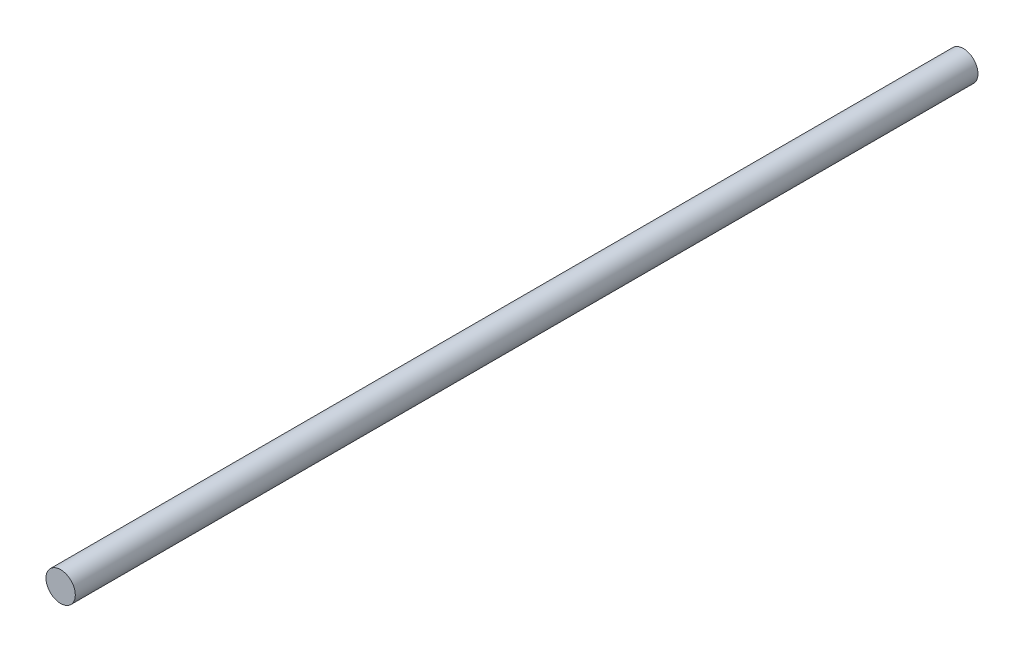
ISO-10303-21;
HEADER;
FILE_DESCRIPTION(('STEP AP214'),'2;1');
FILE_NAME('part.step','',(''),(''),'','','');
FILE_SCHEMA(('AUTOMOTIVE_DESIGN { 1 0 10303 214 1 1 1 1 }'));
ENDSEC;
DATA;
#1=APPLICATION_CONTEXT('core data for automotive mechanical design processes');
#2=APPLICATION_PROTOCOL_DEFINITION('international standard','automotive_design',2000,#1);
#3=PRODUCT_CONTEXT('',#1,'mechanical');
#4=PRODUCT('Part','Part','',(#3));
#5=PRODUCT_RELATED_PRODUCT_CATEGORY('part','',(#4));
#6=PRODUCT_DEFINITION_FORMATION('','',#4);
#7=PRODUCT_DEFINITION_CONTEXT('part definition',#1,'design');
#8=PRODUCT_DEFINITION('design','',#6,#7);
#9=PRODUCT_DEFINITION_SHAPE('','',#8);
#10=(LENGTH_UNIT() NAMED_UNIT(*) SI_UNIT(.MILLI.,.METRE.));
#11=(NAMED_UNIT(*) PLANE_ANGLE_UNIT() SI_UNIT($,.RADIAN.));
#12=(NAMED_UNIT(*) SI_UNIT($,.STERADIAN.) SOLID_ANGLE_UNIT());
#13=UNCERTAINTY_MEASURE_WITH_UNIT(LENGTH_MEASURE(1.E-05),#10,'distance_accuracy_value','');
#14=(GEOMETRIC_REPRESENTATION_CONTEXT(3) GLOBAL_UNCERTAINTY_ASSIGNED_CONTEXT((#13)) GLOBAL_UNIT_ASSIGNED_CONTEXT((#10,
#11,#12)) REPRESENTATION_CONTEXT('',''));
#15=CARTESIAN_POINT('',(0.,0.,0.));
#16=DIRECTION('',(0.,0.,1.));
#17=DIRECTION('',(1.,0.,0.));
#18=AXIS2_PLACEMENT_3D('',#15,#16,#17);
#19=CARTESIAN_POINT('',(0.,0.,50.8));
#20=DIRECTION('',(0.,0.,-1.));
#21=DIRECTION('',(-1.,0.,0.));
#22=AXIS2_PLACEMENT_3D('',#19,#20,#21);
#23=CYLINDRICAL_SURFACE('',#22,0.8255);
#24=CARTESIAN_POINT('',(0.,0.,50.8));
#25=DIRECTION('',(0.,0.,1.));
#26=DIRECTION('',(1.,0.,0.));
#27=AXIS2_PLACEMENT_3D('',#24,#25,#26);
#28=CIRCLE('',#27,0.8255);
#29=CARTESIAN_POINT('',(0.8255,0.,50.8));
#30=VERTEX_POINT('',#29);
#31=EDGE_CURVE('E10',#30,#30,#28,.T.);
#32=ORIENTED_EDGE('',*,*,#31,.F.);
#33=EDGE_LOOP('',(#32));
#34=FACE_BOUND('',#33,.T.);
#35=CARTESIAN_POINT('',(0.,0.,0.));
#36=DIRECTION('',(0.,0.,1.));
#37=DIRECTION('',(1.,0.,0.));
#38=AXIS2_PLACEMENT_3D('',#35,#36,#37);
#39=CIRCLE('',#38,0.8255);
#40=CARTESIAN_POINT('',(0.8255,0.,0.));
#41=VERTEX_POINT('',#40);
#42=EDGE_CURVE('E34',#41,#41,#39,.T.);
#43=ORIENTED_EDGE('',*,*,#42,.T.);
#44=EDGE_LOOP('',(#43));
#45=FACE_BOUND('',#44,.T.);
#46=ADVANCED_FACE('F31',(#34,#45),#23,.T.);
#47=CARTESIAN_POINT('',(0.,0.,50.8));
#48=DIRECTION('',(0.,0.,1.));
#49=DIRECTION('',(1.,0.,0.));
#50=AXIS2_PLACEMENT_3D('',#47,#48,#49);
#51=PLANE('',#50);
#52=ORIENTED_EDGE('',*,*,#31,.T.);
#53=EDGE_LOOP('',(#52));
#54=FACE_BOUND('',#53,.T.);
#55=ADVANCED_FACE('F46',(#54),#51,.T.);
#56=CARTESIAN_POINT('',(0.,0.,0.));
#57=DIRECTION('',(0.,0.,1.));
#58=DIRECTION('',(1.,0.,0.));
#59=AXIS2_PLACEMENT_3D('',#56,#57,#58);
#60=PLANE('',#59);
#61=ORIENTED_EDGE('',*,*,#42,.F.);
#62=EDGE_LOOP('',(#61));
#63=FACE_BOUND('',#62,.T.);
#64=ADVANCED_FACE('F44',(#63),#60,.F.);
#65=CLOSED_SHELL('',(#46,#55,#64));
#66=MANIFOLD_SOLID_BREP('B2',#65);
#67=ADVANCED_BREP_SHAPE_REPRESENTATION('',(#18,#66),#14);
#68=SHAPE_DEFINITION_REPRESENTATION(#9,#67);
ENDSEC;
END-ISO-10303-21;
